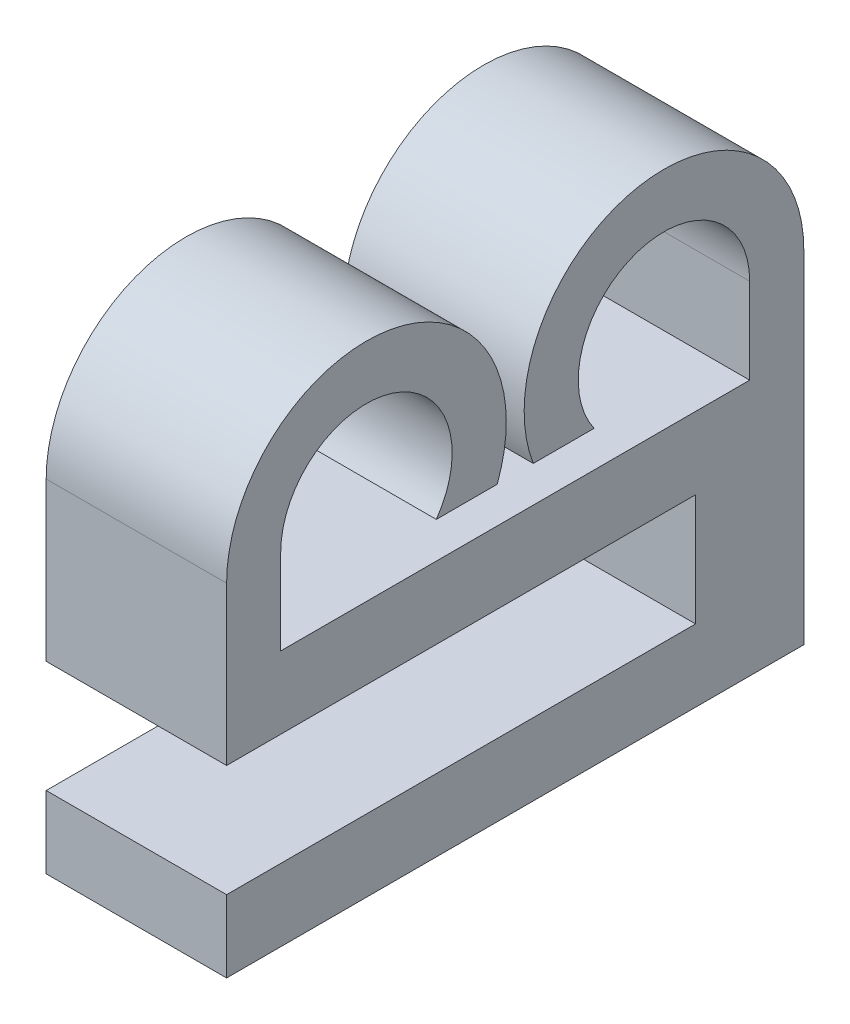
ISO-10303-21;
HEADER;
FILE_DESCRIPTION(('STEP AP214'),'2;1');
FILE_NAME('part.step','',(''),(''),'','','');
FILE_SCHEMA(('AUTOMOTIVE_DESIGN { 1 0 10303 214 1 1 1 1 }'));
ENDSEC;
DATA;
#1=APPLICATION_CONTEXT('core data for automotive mechanical design processes');
#2=APPLICATION_PROTOCOL_DEFINITION('international standard','automotive_design',2000,#1);
#3=PRODUCT_CONTEXT('',#1,'mechanical');
#4=PRODUCT('Part','Part','',(#3));
#5=PRODUCT_RELATED_PRODUCT_CATEGORY('part','',(#4));
#6=PRODUCT_DEFINITION_FORMATION('','',#4);
#7=PRODUCT_DEFINITION_CONTEXT('part definition',#1,'design');
#8=PRODUCT_DEFINITION('design','',#6,#7);
#9=PRODUCT_DEFINITION_SHAPE('','',#8);
#10=(LENGTH_UNIT() NAMED_UNIT(*) SI_UNIT(.MILLI.,.METRE.));
#11=(NAMED_UNIT(*) PLANE_ANGLE_UNIT() SI_UNIT($,.RADIAN.));
#12=(NAMED_UNIT(*) SI_UNIT($,.STERADIAN.) SOLID_ANGLE_UNIT());
#13=UNCERTAINTY_MEASURE_WITH_UNIT(LENGTH_MEASURE(1.E-05),#10,'distance_accuracy_value','');
#14=(GEOMETRIC_REPRESENTATION_CONTEXT(3) GLOBAL_UNCERTAINTY_ASSIGNED_CONTEXT((#13)) GLOBAL_UNIT_ASSIGNED_CONTEXT((#10,
#11,#12)) REPRESENTATION_CONTEXT('',''));
#15=CARTESIAN_POINT('',(0.,0.,0.));
#16=DIRECTION('',(0.,0.,1.));
#17=DIRECTION('',(1.,0.,0.));
#18=AXIS2_PLACEMENT_3D('',#15,#16,#17);
#19=CARTESIAN_POINT('',(5.,-2.,0.));
#20=DIRECTION('',(0.,1.,0.));
#21=DIRECTION('',(0.,0.,1.));
#22=AXIS2_PLACEMENT_3D('',#19,#20,#21);
#23=PLANE('',#22);
#24=DIRECTION('',(-1.,0.,0.));
#25=VECTOR('',#24,1.);
#26=CARTESIAN_POINT('',(21.7890454323394,-2.,-4.99784418654736));
#27=LINE('',#26,#25);
#28=CARTESIAN_POINT('',(5.,-2.,-4.99784418654736));
#29=VERTEX_POINT('',#28);
#30=CARTESIAN_POINT('',(0.,-2.,-4.99784418654736));
#31=VERTEX_POINT('',#30);
#32=EDGE_CURVE('E59',#29,#31,#27,.T.);
#33=ORIENTED_EDGE('',*,*,#32,.F.);
#34=DIRECTION('',(0.,0.,-1.));
#35=VECTOR('',#34,1.);
#36=CARTESIAN_POINT('',(5.,-2.,0.));
#37=LINE('',#36,#35);
#38=CARTESIAN_POINT('',(5.,-2.,7.99784418654736));
#39=VERTEX_POINT('',#38);
#40=EDGE_CURVE('E295',#39,#29,#37,.T.);
#41=ORIENTED_EDGE('',*,*,#40,.F.);
#42=DIRECTION('',(-1.,0.,0.));
#43=VECTOR('',#42,1.);
#44=CARTESIAN_POINT('',(5.,-2.,7.99784418654736));
#45=LINE('',#44,#43);
#46=CARTESIAN_POINT('',(0.,-2.,7.99784418654736));
#47=VERTEX_POINT('',#46);
#48=EDGE_CURVE('E236',#39,#47,#45,.T.);
#49=ORIENTED_EDGE('',*,*,#48,.T.);
#50=DIRECTION('',(0.,0.,-1.));
#51=VECTOR('',#50,1.);
#52=CARTESIAN_POINT('',(0.,-2.,0.));
#53=LINE('',#52,#51);
#54=EDGE_CURVE('E187',#47,#31,#53,.T.);
#55=ORIENTED_EDGE('',*,*,#54,.T.);
#56=EDGE_LOOP('',(#33,#41,#49,#55));
#57=FACE_BOUND('',#56,.T.);
#58=ADVANCED_FACE('F43',(#57),#23,.F.);
#59=CARTESIAN_POINT('',(5.,1.,0.));
#60=DIRECTION('',(0.,1.,0.));
#61=DIRECTION('',(0.,0.,1.));
#62=AXIS2_PLACEMENT_3D('',#59,#60,#61);
#63=PLANE('',#62);
#64=DIRECTION('',(0.,0.,-1.));
#65=VECTOR('',#64,1.);
#66=CARTESIAN_POINT('',(0.,1.,0.));
#67=LINE('',#66,#65);
#68=CARTESIAN_POINT('',(0.,1.,2.18635251344365));
#69=VERTEX_POINT('',#68);
#70=CARTESIAN_POINT('',(0.,1.,0.499999999999999));
#71=VERTEX_POINT('',#70);
#72=EDGE_CURVE('E177',#69,#71,#67,.T.);
#73=ORIENTED_EDGE('',*,*,#72,.T.);
#74=DIRECTION('',(-1.,0.,0.));
#75=VECTOR('',#74,1.);
#76=CARTESIAN_POINT('',(5.,1.,0.499999999999999));
#77=LINE('',#76,#75);
#78=CARTESIAN_POINT('',(5.,1.,0.499999999999999));
#79=VERTEX_POINT('',#78);
#80=EDGE_CURVE('E11',#79,#71,#77,.T.);
#81=ORIENTED_EDGE('',*,*,#80,.F.);
#82=DIRECTION('',(0.,0.,-1.));
#83=VECTOR('',#82,1.);
#84=CARTESIAN_POINT('',(5.,1.,0.));
#85=LINE('',#84,#83);
#86=CARTESIAN_POINT('',(5.,1.,2.18635251344365));
#87=VERTEX_POINT('',#86);
#88=EDGE_CURVE('E214',#87,#79,#85,.T.);
#89=ORIENTED_EDGE('',*,*,#88,.F.);
#90=DIRECTION('',(-1.,0.,0.));
#91=VECTOR('',#90,1.);
#92=CARTESIAN_POINT('',(5.,1.,2.18635251344365));
#93=LINE('',#92,#91);
#94=EDGE_CURVE('E176',#87,#69,#93,.T.);
#95=ORIENTED_EDGE('',*,*,#94,.T.);
#96=EDGE_LOOP('',(#73,#81,#89,#95));
#97=FACE_BOUND('',#96,.T.);
#98=ADVANCED_FACE('F45',(#97),#63,.F.);
#99=CARTESIAN_POINT('',(5.,2.375,4.12284418654736));
#100=DIRECTION('',(-1.,0.,0.));
#101=DIRECTION('',(0.,0.,1.));
#102=AXIS2_PLACEMENT_3D('',#99,#100,#101);
#103=CYLINDRICAL_SURFACE('',#102,3.875);
#104=CARTESIAN_POINT('',(0.,2.375,4.12284418654736));
#105=DIRECTION('',(1.,0.,0.));
#106=DIRECTION('',(0.,0.,-1.));
#107=AXIS2_PLACEMENT_3D('',#104,#105,#106);
#108=CIRCLE('',#107,3.875);
#109=CARTESIAN_POINT('',(0.,2.375,7.99784418654736));
#110=VERTEX_POINT('',#109);
#111=EDGE_CURVE('E181',#71,#110,#108,.T.);
#112=ORIENTED_EDGE('',*,*,#111,.T.);
#113=DIRECTION('',(-1.,0.,0.));
#114=VECTOR('',#113,1.);
#115=CARTESIAN_POINT('',(5.,2.375,7.99784418654736));
#116=LINE('',#115,#114);
#117=CARTESIAN_POINT('',(5.,2.375,7.99784418654736));
#118=VERTEX_POINT('',#117);
#119=EDGE_CURVE('E52',#118,#110,#116,.T.);
#120=ORIENTED_EDGE('',*,*,#119,.F.);
#121=CARTESIAN_POINT('',(5.,2.375,4.12284418654736));
#122=DIRECTION('',(1.,0.,0.));
#123=DIRECTION('',(0.,0.,-1.));
#124=AXIS2_PLACEMENT_3D('',#121,#122,#123);
#125=CIRCLE('',#124,3.875);
#126=EDGE_CURVE('E118',#79,#118,#125,.T.);
#127=ORIENTED_EDGE('',*,*,#126,.F.);
#128=ORIENTED_EDGE('',*,*,#80,.T.);
#129=EDGE_LOOP('',(#112,#120,#127,#128));
#130=FACE_BOUND('',#129,.T.);
#131=ADVANCED_FACE('F385',(#130),#103,.T.);
#132=CARTESIAN_POINT('',(5.,0.,7.99784418654736));
#133=DIRECTION('',(0.,0.,-1.));
#134=DIRECTION('',(-1.,0.,0.));
#135=AXIS2_PLACEMENT_3D('',#132,#133,#134);
#136=PLANE('',#135);
#137=DIRECTION('',(0.,-1.,0.));
#138=VECTOR('',#137,1.);
#139=CARTESIAN_POINT('',(0.,0.,7.99784418654736));
#140=LINE('',#139,#138);
#141=EDGE_CURVE('E184',#110,#47,#140,.T.);
#142=ORIENTED_EDGE('',*,*,#141,.T.);
#143=ORIENTED_EDGE('',*,*,#48,.F.);
#144=DIRECTION('',(0.,-1.,0.));
#145=VECTOR('',#144,1.);
#146=CARTESIAN_POINT('',(5.,0.,7.99784418654736));
#147=LINE('',#146,#145);
#148=EDGE_CURVE('E246',#118,#39,#147,.T.);
#149=ORIENTED_EDGE('',*,*,#148,.F.);
#150=ORIENTED_EDGE('',*,*,#119,.T.);
#151=EDGE_LOOP('',(#142,#143,#149,#150));
#152=FACE_BOUND('',#151,.T.);
#153=ADVANCED_FACE('F244',(#152),#136,.F.);
#154=CARTESIAN_POINT('',(5.,0.,-7.99784418654736));
#155=DIRECTION('',(0.,0.,-1.));
#156=DIRECTION('',(0.,1.,0.));
#157=AXIS2_PLACEMENT_3D('',#154,#155,#156);
#158=PLANE('',#157);
#159=DIRECTION('',(0.,-1.,0.));
#160=VECTOR('',#159,1.);
#161=CARTESIAN_POINT('',(0.,0.,-7.99784418654736));
#162=LINE('',#161,#160);
#163=CARTESIAN_POINT('',(0.,2.375,-7.99784418654736));
#164=VERTEX_POINT('',#163);
#165=CARTESIAN_POINT('',(0.,-7.1,-7.99784418654736));
#166=VERTEX_POINT('',#165);
#167=EDGE_CURVE('E190',#164,#166,#162,.T.);
#168=ORIENTED_EDGE('',*,*,#167,.F.);
#169=DIRECTION('',(-1.,0.,0.));
#170=VECTOR('',#169,1.);
#171=CARTESIAN_POINT('',(5.,2.375,-7.99784418654736));
#172=LINE('',#171,#170);
#173=CARTESIAN_POINT('',(5.,2.375,-7.99784418654736));
#174=VERTEX_POINT('',#173);
#175=EDGE_CURVE('E233',#174,#164,#172,.T.);
#176=ORIENTED_EDGE('',*,*,#175,.F.);
#177=DIRECTION('',(0.,-1.,0.));
#178=VECTOR('',#177,1.);
#179=CARTESIAN_POINT('',(5.,0.,-7.99784418654736));
#180=LINE('',#179,#178);
#181=CARTESIAN_POINT('',(5.,-7.1,-7.99784418654736));
#182=VERTEX_POINT('',#181);
#183=EDGE_CURVE('E298',#174,#182,#180,.T.);
#184=ORIENTED_EDGE('',*,*,#183,.T.);
#185=DIRECTION('',(-1.,0.,0.));
#186=VECTOR('',#185,1.);
#187=CARTESIAN_POINT('',(21.7890454323394,-7.1,-7.99784418654736));
#188=LINE('',#187,#186);
#189=EDGE_CURVE('E285',#182,#166,#188,.T.);
#190=ORIENTED_EDGE('',*,*,#189,.T.);
#191=EDGE_LOOP('',(#168,#176,#184,#190));
#192=FACE_BOUND('',#191,.T.);
#193=ADVANCED_FACE('F374',(#192),#158,.T.);
#194=CARTESIAN_POINT('',(5.,2.375,-4.12284418654736));
#195=DIRECTION('',(-1.,0.,0.));
#196=DIRECTION('',(0.,0.,1.));
#197=AXIS2_PLACEMENT_3D('',#194,#195,#196);
#198=CYLINDRICAL_SURFACE('',#197,3.875);
#199=CARTESIAN_POINT('',(0.,2.375,-4.12284418654736));
#200=DIRECTION('',(1.,0.,0.));
#201=DIRECTION('',(0.,0.,-1.));
#202=AXIS2_PLACEMENT_3D('',#199,#200,#201);
#203=CIRCLE('',#202,3.875);
#204=CARTESIAN_POINT('',(0.,1.,-0.500000000000001));
#205=VERTEX_POINT('',#204);
#206=EDGE_CURVE('E194',#164,#205,#203,.T.);
#207=ORIENTED_EDGE('',*,*,#206,.T.);
#208=DIRECTION('',(-1.,0.,0.));
#209=VECTOR('',#208,1.);
#210=CARTESIAN_POINT('',(5.,1.,-0.500000000000001));
#211=LINE('',#210,#209);
#212=CARTESIAN_POINT('',(5.,1.,-0.500000000000001));
#213=VERTEX_POINT('',#212);
#214=EDGE_CURVE('E229',#213,#205,#211,.T.);
#215=ORIENTED_EDGE('',*,*,#214,.F.);
#216=CARTESIAN_POINT('',(5.,2.375,-4.12284418654736));
#217=DIRECTION('',(1.,0.,0.));
#218=DIRECTION('',(0.,0.,-1.));
#219=AXIS2_PLACEMENT_3D('',#216,#217,#218);
#220=CIRCLE('',#219,3.875);
#221=EDGE_CURVE('E302',#174,#213,#220,.T.);
#222=ORIENTED_EDGE('',*,*,#221,.F.);
#223=ORIENTED_EDGE('',*,*,#175,.T.);
#224=EDGE_LOOP('',(#207,#215,#222,#223));
#225=FACE_BOUND('',#224,.T.);
#226=ADVANCED_FACE('F376',(#225),#198,.T.);
#227=CARTESIAN_POINT('',(5.,1.,0.));
#228=DIRECTION('',(0.,1.,0.));
#229=DIRECTION('',(0.,0.,1.));
#230=AXIS2_PLACEMENT_3D('',#227,#228,#229);
#231=PLANE('',#230);
#232=DIRECTION('',(0.,0.,-1.));
#233=VECTOR('',#232,1.);
#234=CARTESIAN_POINT('',(0.,1.,0.));
#235=LINE('',#234,#233);
#236=CARTESIAN_POINT('',(0.,1.,-2.18635251344365));
#237=VERTEX_POINT('',#236);
#238=EDGE_CURVE('E197',#205,#237,#235,.T.);
#239=ORIENTED_EDGE('',*,*,#238,.T.);
#240=DIRECTION('',(-1.,0.,0.));
#241=VECTOR('',#240,1.);
#242=CARTESIAN_POINT('',(5.,1.,-2.18635251344365));
#243=LINE('',#242,#241);
#244=CARTESIAN_POINT('',(5.,1.,-2.18635251344365));
#245=VERTEX_POINT('',#244);
#246=EDGE_CURVE('E225',#245,#237,#243,.T.);
#247=ORIENTED_EDGE('',*,*,#246,.F.);
#248=DIRECTION('',(0.,0.,-1.));
#249=VECTOR('',#248,1.);
#250=CARTESIAN_POINT('',(5.,1.,0.));
#251=LINE('',#250,#249);
#252=EDGE_CURVE('E305',#213,#245,#251,.T.);
#253=ORIENTED_EDGE('',*,*,#252,.F.);
#254=ORIENTED_EDGE('',*,*,#214,.T.);
#255=EDGE_LOOP('',(#239,#247,#253,#254));
#256=FACE_BOUND('',#255,.T.);
#257=ADVANCED_FACE('F382',(#256),#231,.F.);
#258=CARTESIAN_POINT('',(5.,2.375,-4.12284418654736));
#259=DIRECTION('',(-1.,0.,0.));
#260=DIRECTION('',(0.,0.,1.));
#261=AXIS2_PLACEMENT_3D('',#258,#259,#260);
#262=CYLINDRICAL_SURFACE('',#261,2.375);
#263=CARTESIAN_POINT('',(0.,2.375,-4.12284418654736));
#264=DIRECTION('',(1.,0.,0.));
#265=DIRECTION('',(0.,0.,-1.));
#266=AXIS2_PLACEMENT_3D('',#263,#264,#265);
#267=CIRCLE('',#266,2.375);
#268=CARTESIAN_POINT('',(0.,2.375,-6.49784418654736));
#269=VERTEX_POINT('',#268);
#270=EDGE_CURVE('E200',#237,#269,#267,.F.);
#271=ORIENTED_EDGE('',*,*,#270,.T.);
#272=DIRECTION('',(-1.,0.,0.));
#273=VECTOR('',#272,1.);
#274=CARTESIAN_POINT('',(5.,2.375,-6.49784418654736));
#275=LINE('',#274,#273);
#276=CARTESIAN_POINT('',(5.,2.375,-6.49784418654736));
#277=VERTEX_POINT('',#276);
#278=EDGE_CURVE('E221',#277,#269,#275,.T.);
#279=ORIENTED_EDGE('',*,*,#278,.F.);
#280=CARTESIAN_POINT('',(5.,2.375,-4.12284418654736));
#281=DIRECTION('',(1.,0.,0.));
#282=DIRECTION('',(0.,0.,-1.));
#283=AXIS2_PLACEMENT_3D('',#280,#281,#282);
#284=CIRCLE('',#283,2.375);
#285=EDGE_CURVE('E170',#245,#277,#284,.F.);
#286=ORIENTED_EDGE('',*,*,#285,.F.);
#287=ORIENTED_EDGE('',*,*,#246,.T.);
#288=EDGE_LOOP('',(#271,#279,#286,#287));
#289=FACE_BOUND('',#288,.T.);
#290=ADVANCED_FACE('F313',(#289),#262,.F.);
#291=CARTESIAN_POINT('',(5.,0.,-6.49784418654736));
#292=DIRECTION('',(0.,0.,-1.));
#293=DIRECTION('',(0.,1.,0.));
#294=AXIS2_PLACEMENT_3D('',#291,#292,#293);
#295=PLANE('',#294);
#296=DIRECTION('',(0.,-1.,0.));
#297=VECTOR('',#296,1.);
#298=CARTESIAN_POINT('',(0.,0.,-6.49784418654736));
#299=LINE('',#298,#297);
#300=CARTESIAN_POINT('',(0.,0.,-6.49784418654736));
#301=VERTEX_POINT('',#300);
#302=EDGE_CURVE('E203',#269,#301,#299,.T.);
#303=ORIENTED_EDGE('',*,*,#302,.T.);
#304=DIRECTION('',(-1.,0.,0.));
#305=VECTOR('',#304,1.);
#306=CARTESIAN_POINT('',(5.,0.,-6.49784418654736));
#307=LINE('',#306,#305);
#308=CARTESIAN_POINT('',(5.,0.,-6.49784418654736));
#309=VERTEX_POINT('',#308);
#310=EDGE_CURVE('E155',#309,#301,#307,.T.);
#311=ORIENTED_EDGE('',*,*,#310,.F.);
#312=DIRECTION('',(0.,-1.,0.));
#313=VECTOR('',#312,1.);
#314=CARTESIAN_POINT('',(5.,0.,-6.49784418654736));
#315=LINE('',#314,#313);
#316=EDGE_CURVE('E165',#277,#309,#315,.T.);
#317=ORIENTED_EDGE('',*,*,#316,.F.);
#318=ORIENTED_EDGE('',*,*,#278,.T.);
#319=EDGE_LOOP('',(#303,#311,#317,#318));
#320=FACE_BOUND('',#319,.T.);
#321=ADVANCED_FACE('F317',(#320),#295,.F.);
#322=CARTESIAN_POINT('',(5.,0.,0.));
#323=DIRECTION('',(0.,1.,0.));
#324=DIRECTION('',(0.,0.,1.));
#325=AXIS2_PLACEMENT_3D('',#322,#323,#324);
#326=PLANE('',#325);
#327=DIRECTION('',(0.,0.,-1.));
#328=VECTOR('',#327,1.);
#329=CARTESIAN_POINT('',(0.,0.,0.));
#330=LINE('',#329,#328);
#331=CARTESIAN_POINT('',(0.,0.,6.49784418654736));
#332=VERTEX_POINT('',#331);
#333=EDGE_CURVE('E151',#332,#301,#330,.T.);
#334=ORIENTED_EDGE('',*,*,#333,.F.);
#335=DIRECTION('',(-1.,0.,0.));
#336=VECTOR('',#335,1.);
#337=CARTESIAN_POINT('',(5.,0.,6.49784418654736));
#338=LINE('',#337,#336);
#339=CARTESIAN_POINT('',(5.,0.,6.49784418654736));
#340=VERTEX_POINT('',#339);
#341=EDGE_CURVE('E145',#340,#332,#338,.T.);
#342=ORIENTED_EDGE('',*,*,#341,.F.);
#343=DIRECTION('',(0.,0.,-1.));
#344=VECTOR('',#343,1.);
#345=CARTESIAN_POINT('',(5.,0.,0.));
#346=LINE('',#345,#344);
#347=EDGE_CURVE('E149',#340,#309,#346,.T.);
#348=ORIENTED_EDGE('',*,*,#347,.T.);
#349=ORIENTED_EDGE('',*,*,#310,.T.);
#350=EDGE_LOOP('',(#334,#342,#348,#349));
#351=FACE_BOUND('',#350,.T.);
#352=ADVANCED_FACE('F147',(#351),#326,.T.);
#353=CARTESIAN_POINT('',(5.,0.,6.49784418654736));
#354=DIRECTION('',(0.,0.,1.));
#355=DIRECTION('',(1.,0.,0.));
#356=AXIS2_PLACEMENT_3D('',#353,#354,#355);
#357=PLANE('',#356);
#358=DIRECTION('',(0.,1.,0.));
#359=VECTOR('',#358,1.);
#360=CARTESIAN_POINT('',(0.,0.,6.49784418654736));
#361=LINE('',#360,#359);
#362=CARTESIAN_POINT('',(0.,2.375,6.49784418654736));
#363=VERTEX_POINT('',#362);
#364=EDGE_CURVE('E209',#332,#363,#361,.T.);
#365=ORIENTED_EDGE('',*,*,#364,.T.);
#366=DIRECTION('',(-1.,0.,0.));
#367=VECTOR('',#366,1.);
#368=CARTESIAN_POINT('',(5.,2.375,6.49784418654736));
#369=LINE('',#368,#367);
#370=CARTESIAN_POINT('',(5.,2.375,6.49784418654736));
#371=VERTEX_POINT('',#370);
#372=EDGE_CURVE('E156',#371,#363,#369,.T.);
#373=ORIENTED_EDGE('',*,*,#372,.F.);
#374=DIRECTION('',(0.,1.,0.));
#375=VECTOR('',#374,1.);
#376=CARTESIAN_POINT('',(5.,0.,6.49784418654736));
#377=LINE('',#376,#375);
#378=EDGE_CURVE('E159',#340,#371,#377,.T.);
#379=ORIENTED_EDGE('',*,*,#378,.F.);
#380=ORIENTED_EDGE('',*,*,#341,.T.);
#381=EDGE_LOOP('',(#365,#373,#379,#380));
#382=FACE_BOUND('',#381,.T.);
#383=ADVANCED_FACE('F160',(#382),#357,.F.);
#384=CARTESIAN_POINT('',(5.,2.375,4.12284418654736));
#385=DIRECTION('',(-1.,0.,0.));
#386=DIRECTION('',(0.,0.,1.));
#387=AXIS2_PLACEMENT_3D('',#384,#385,#386);
#388=CYLINDRICAL_SURFACE('',#387,2.375);
#389=CARTESIAN_POINT('',(0.,2.375,4.12284418654736));
#390=DIRECTION('',(1.,0.,0.));
#391=DIRECTION('',(0.,0.,-1.));
#392=AXIS2_PLACEMENT_3D('',#389,#390,#391);
#393=CIRCLE('',#392,2.375);
#394=EDGE_CURVE('E110',#363,#69,#393,.F.);
#395=ORIENTED_EDGE('',*,*,#394,.T.);
#396=ORIENTED_EDGE('',*,*,#94,.F.);
#397=CARTESIAN_POINT('',(5.,2.375,4.12284418654736));
#398=DIRECTION('',(1.,0.,0.));
#399=DIRECTION('',(0.,0.,-1.));
#400=AXIS2_PLACEMENT_3D('',#397,#398,#399);
#401=CIRCLE('',#400,2.375);
#402=EDGE_CURVE('E68',#371,#87,#401,.F.);
#403=ORIENTED_EDGE('',*,*,#402,.F.);
#404=ORIENTED_EDGE('',*,*,#372,.T.);
#405=EDGE_LOOP('',(#395,#396,#403,#404));
#406=FACE_BOUND('',#405,.T.);
#407=ADVANCED_FACE('F318',(#406),#388,.F.);
#408=CARTESIAN_POINT('',(5.,0.,0.));
#409=DIRECTION('',(1.,0.,0.));
#410=DIRECTION('',(0.,0.,-1.));
#411=AXIS2_PLACEMENT_3D('',#408,#409,#410);
#412=PLANE('',#411);
#413=ORIENTED_EDGE('',*,*,#88,.T.);
#414=ORIENTED_EDGE('',*,*,#126,.T.);
#415=ORIENTED_EDGE('',*,*,#148,.T.);
#416=ORIENTED_EDGE('',*,*,#40,.T.);
#417=DIRECTION('',(0.,1.,0.));
#418=VECTOR('',#417,1.);
#419=CARTESIAN_POINT('',(5.,-5.1,-4.99784418654736));
#420=LINE('',#419,#418);
#421=CARTESIAN_POINT('',(5.,-5.1,-4.99784418654736));
#422=VERTEX_POINT('',#421);
#423=EDGE_CURVE('E262',#422,#29,#420,.T.);
#424=ORIENTED_EDGE('',*,*,#423,.F.);
#425=DIRECTION('',(0.,0.,-1.));
#426=VECTOR('',#425,1.);
#427=CARTESIAN_POINT('',(5.,-5.1,7.99784418654736));
#428=LINE('',#427,#426);
#429=CARTESIAN_POINT('',(5.,-5.1,7.99784418654736));
#430=VERTEX_POINT('',#429);
#431=EDGE_CURVE('E275',#430,#422,#428,.T.);
#432=ORIENTED_EDGE('',*,*,#431,.F.);
#433=DIRECTION('',(0.,1.,0.));
#434=VECTOR('',#433,1.);
#435=CARTESIAN_POINT('',(5.,-7.1,7.99784418654736));
#436=LINE('',#435,#434);
#437=CARTESIAN_POINT('',(5.,-7.1,7.99784418654736));
#438=VERTEX_POINT('',#437);
#439=EDGE_CURVE('E280',#438,#430,#436,.T.);
#440=ORIENTED_EDGE('',*,*,#439,.F.);
#441=DIRECTION('',(0.,0.,1.));
#442=VECTOR('',#441,1.);
#443=CARTESIAN_POINT('',(5.,-7.1,-7.99784418654736));
#444=LINE('',#443,#442);
#445=EDGE_CURVE('E270',#182,#438,#444,.T.);
#446=ORIENTED_EDGE('',*,*,#445,.F.);
#447=ORIENTED_EDGE('',*,*,#183,.F.);
#448=ORIENTED_EDGE('',*,*,#221,.T.);
#449=ORIENTED_EDGE('',*,*,#252,.T.);
#450=ORIENTED_EDGE('',*,*,#285,.T.);
#451=ORIENTED_EDGE('',*,*,#316,.T.);
#452=ORIENTED_EDGE('',*,*,#347,.F.);
#453=ORIENTED_EDGE('',*,*,#378,.T.);
#454=ORIENTED_EDGE('',*,*,#402,.T.);
#455=EDGE_LOOP('',(#413,#414,#415,#416,#424,#432,#440,#446,#447,#448,#449,#450,#451,#452,#453,#454));
#456=FACE_BOUND('',#455,.T.);
#457=ADVANCED_FACE('F163',(#456),#412,.T.);
#458=CARTESIAN_POINT('',(0.,0.,0.));
#459=DIRECTION('',(1.,0.,0.));
#460=DIRECTION('',(0.,0.,-1.));
#461=AXIS2_PLACEMENT_3D('',#458,#459,#460);
#462=PLANE('',#461);
#463=ORIENTED_EDGE('',*,*,#72,.F.);
#464=ORIENTED_EDGE('',*,*,#394,.F.);
#465=ORIENTED_EDGE('',*,*,#364,.F.);
#466=ORIENTED_EDGE('',*,*,#333,.T.);
#467=ORIENTED_EDGE('',*,*,#302,.F.);
#468=ORIENTED_EDGE('',*,*,#270,.F.);
#469=ORIENTED_EDGE('',*,*,#238,.F.);
#470=ORIENTED_EDGE('',*,*,#206,.F.);
#471=ORIENTED_EDGE('',*,*,#167,.T.);
#472=DIRECTION('',(0.,0.,1.));
#473=VECTOR('',#472,1.);
#474=CARTESIAN_POINT('',(0.,-7.1,-7.99784418654736));
#475=LINE('',#474,#473);
#476=CARTESIAN_POINT('',(0.,-7.1,7.99784418654736));
#477=VERTEX_POINT('',#476);
#478=EDGE_CURVE('E359',#166,#477,#475,.T.);
#479=ORIENTED_EDGE('',*,*,#478,.T.);
#480=DIRECTION('',(0.,1.,0.));
#481=VECTOR('',#480,1.);
#482=CARTESIAN_POINT('',(0.,-7.1,7.99784418654736));
#483=LINE('',#482,#481);
#484=CARTESIAN_POINT('',(0.,-5.1,7.99784418654736));
#485=VERTEX_POINT('',#484);
#486=EDGE_CURVE('E361',#477,#485,#483,.T.);
#487=ORIENTED_EDGE('',*,*,#486,.T.);
#488=DIRECTION('',(0.,0.,-1.));
#489=VECTOR('',#488,1.);
#490=CARTESIAN_POINT('',(0.,-5.1,7.99784418654736));
#491=LINE('',#490,#489);
#492=CARTESIAN_POINT('',(0.,-5.1,-4.99784418654736));
#493=VERTEX_POINT('',#492);
#494=EDGE_CURVE('E363',#485,#493,#491,.T.);
#495=ORIENTED_EDGE('',*,*,#494,.T.);
#496=DIRECTION('',(0.,1.,0.));
#497=VECTOR('',#496,1.);
#498=CARTESIAN_POINT('',(0.,-5.1,-4.99784418654736));
#499=LINE('',#498,#497);
#500=EDGE_CURVE('E254',#493,#31,#499,.T.);
#501=ORIENTED_EDGE('',*,*,#500,.T.);
#502=ORIENTED_EDGE('',*,*,#54,.F.);
#503=ORIENTED_EDGE('',*,*,#141,.F.);
#504=ORIENTED_EDGE('',*,*,#111,.F.);
#505=EDGE_LOOP('',(#463,#464,#465,#466,#467,#468,#469,#470,#471,#479,#487,#495,#501,#502,#503,#504));
#506=FACE_BOUND('',#505,.T.);
#507=ADVANCED_FACE('F250',(#506),#462,.F.);
#508=CARTESIAN_POINT('',(21.7890454323394,-7.1,-7.99784418654736));
#509=DIRECTION('',(0.,-1.,0.));
#510=DIRECTION('',(0.,0.,-1.));
#511=AXIS2_PLACEMENT_3D('',#508,#509,#510);
#512=PLANE('',#511);
#513=ORIENTED_EDGE('',*,*,#189,.F.);
#514=ORIENTED_EDGE('',*,*,#445,.T.);
#515=DIRECTION('',(-1.,0.,0.));
#516=VECTOR('',#515,1.);
#517=CARTESIAN_POINT('',(21.7890454323394,-7.1,7.99784418654736));
#518=LINE('',#517,#516);
#519=EDGE_CURVE('E281',#438,#477,#518,.T.);
#520=ORIENTED_EDGE('',*,*,#519,.T.);
#521=ORIENTED_EDGE('',*,*,#478,.F.);
#522=EDGE_LOOP('',(#513,#514,#520,#521));
#523=FACE_BOUND('',#522,.T.);
#524=ADVANCED_FACE('F357',(#523),#512,.T.);
#525=CARTESIAN_POINT('',(21.7890454323394,-7.1,7.99784418654736));
#526=DIRECTION('',(0.,0.,1.));
#527=DIRECTION('',(1.,0.,0.));
#528=AXIS2_PLACEMENT_3D('',#525,#526,#527);
#529=PLANE('',#528);
#530=ORIENTED_EDGE('',*,*,#519,.F.);
#531=ORIENTED_EDGE('',*,*,#439,.T.);
#532=DIRECTION('',(-1.,0.,0.));
#533=VECTOR('',#532,1.);
#534=CARTESIAN_POINT('',(21.7890454323394,-5.1,7.99784418654736));
#535=LINE('',#534,#533);
#536=EDGE_CURVE('E276',#430,#485,#535,.T.);
#537=ORIENTED_EDGE('',*,*,#536,.T.);
#538=ORIENTED_EDGE('',*,*,#486,.F.);
#539=EDGE_LOOP('',(#530,#531,#537,#538));
#540=FACE_BOUND('',#539,.T.);
#541=ADVANCED_FACE('F339',(#540),#529,.T.);
#542=CARTESIAN_POINT('',(21.7890454323394,-5.1,7.99784418654736));
#543=DIRECTION('',(0.,1.,0.));
#544=DIRECTION('',(0.,0.,1.));
#545=AXIS2_PLACEMENT_3D('',#542,#543,#544);
#546=PLANE('',#545);
#547=ORIENTED_EDGE('',*,*,#536,.F.);
#548=ORIENTED_EDGE('',*,*,#431,.T.);
#549=DIRECTION('',(-1.,0.,0.));
#550=VECTOR('',#549,1.);
#551=CARTESIAN_POINT('',(21.7890454323394,-5.1,-4.99784418654736));
#552=LINE('',#551,#550);
#553=EDGE_CURVE('E266',#422,#493,#552,.T.);
#554=ORIENTED_EDGE('',*,*,#553,.T.);
#555=ORIENTED_EDGE('',*,*,#494,.F.);
#556=EDGE_LOOP('',(#547,#548,#554,#555));
#557=FACE_BOUND('',#556,.T.);
#558=ADVANCED_FACE('F331',(#557),#546,.T.);
#559=CARTESIAN_POINT('',(21.7890454323394,-5.1,-4.99784418654736));
#560=DIRECTION('',(0.,0.,1.));
#561=DIRECTION('',(1.,0.,0.));
#562=AXIS2_PLACEMENT_3D('',#559,#560,#561);
#563=PLANE('',#562);
#564=ORIENTED_EDGE('',*,*,#553,.F.);
#565=ORIENTED_EDGE('',*,*,#423,.T.);
#566=ORIENTED_EDGE('',*,*,#32,.T.);
#567=ORIENTED_EDGE('',*,*,#500,.F.);
#568=EDGE_LOOP('',(#564,#565,#566,#567));
#569=FACE_BOUND('',#568,.T.);
#570=ADVANCED_FACE('F260',(#569),#563,.T.);
#571=CLOSED_SHELL('',(#58,#98,#131,#153,#193,#226,#257,#290,#321,#352,#383,#407,#457,#507,#524,
#541,#558,#570));
#572=MANIFOLD_SOLID_BREP('B2',#571);
#573=ADVANCED_BREP_SHAPE_REPRESENTATION('',(#18,#572),#14);
#574=SHAPE_DEFINITION_REPRESENTATION(#9,#573);
ENDSEC;
END-ISO-10303-21;
